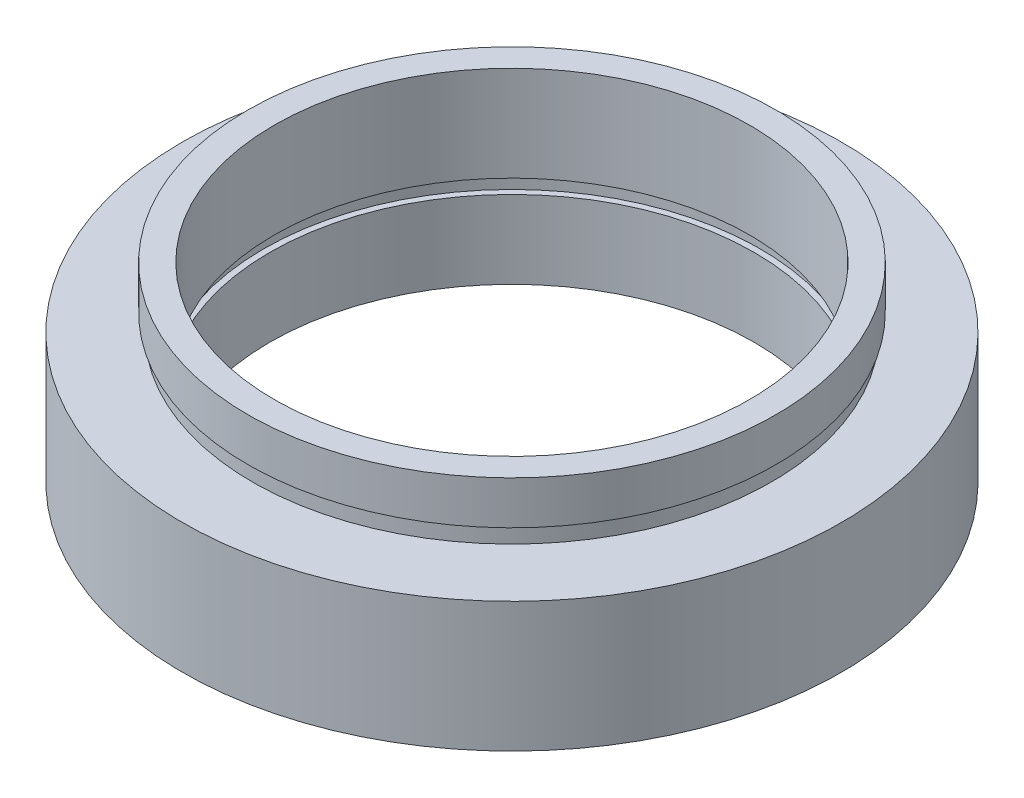
ISO-10303-21;
HEADER;
FILE_DESCRIPTION(('STEP AP214'),'2;1');
FILE_NAME('part.step','',(''),(''),'','','');
FILE_SCHEMA(('AUTOMOTIVE_DESIGN { 1 0 10303 214 1 1 1 1 }'));
ENDSEC;
DATA;
#1=APPLICATION_CONTEXT('core data for automotive mechanical design processes');
#2=APPLICATION_PROTOCOL_DEFINITION('international standard','automotive_design',2000,#1);
#3=PRODUCT_CONTEXT('',#1,'mechanical');
#4=PRODUCT('Part','Part','',(#3));
#5=PRODUCT_RELATED_PRODUCT_CATEGORY('part','',(#4));
#6=PRODUCT_DEFINITION_FORMATION('','',#4);
#7=PRODUCT_DEFINITION_CONTEXT('part definition',#1,'design');
#8=PRODUCT_DEFINITION('design','',#6,#7);
#9=PRODUCT_DEFINITION_SHAPE('','',#8);
#10=(LENGTH_UNIT() NAMED_UNIT(*) SI_UNIT(.MILLI.,.METRE.));
#11=(NAMED_UNIT(*) PLANE_ANGLE_UNIT() SI_UNIT($,.RADIAN.));
#12=(NAMED_UNIT(*) SI_UNIT($,.STERADIAN.) SOLID_ANGLE_UNIT());
#13=UNCERTAINTY_MEASURE_WITH_UNIT(LENGTH_MEASURE(1.E-05),#10,'distance_accuracy_value','');
#14=(GEOMETRIC_REPRESENTATION_CONTEXT(3) GLOBAL_UNCERTAINTY_ASSIGNED_CONTEXT((#13)) GLOBAL_UNIT_ASSIGNED_CONTEXT((#10,
#11,#12)) REPRESENTATION_CONTEXT('',''));
#15=CARTESIAN_POINT('',(0.,0.,0.));
#16=DIRECTION('',(0.,0.,1.));
#17=DIRECTION('',(1.,0.,0.));
#18=AXIS2_PLACEMENT_3D('',#15,#16,#17);
#19=CARTESIAN_POINT('',(19.05,0.,0.));
#20=DIRECTION('',(0.,1.,0.));
#21=DIRECTION('',(-1.,0.,0.));
#22=AXIS2_PLACEMENT_3D('',#19,#20,#21);
#23=PLANE('',#22);
#24=CARTESIAN_POINT('',(0.,0.,0.));
#25=DIRECTION('',(0.,1.,0.));
#26=DIRECTION('',(-1.,0.,0.));
#27=AXIS2_PLACEMENT_3D('',#24,#25,#26);
#28=CIRCLE('',#27,19.05);
#29=CARTESIAN_POINT('',(-19.05,0.,0.));
#30=VERTEX_POINT('',#29);
#31=EDGE_CURVE('E77',#30,#30,#28,.T.);
#32=ORIENTED_EDGE('',*,*,#31,.F.);
#33=EDGE_LOOP('',(#32));
#34=FACE_BOUND('',#33,.T.);
#35=CARTESIAN_POINT('',(0.,0.,0.));
#36=DIRECTION('',(0.,1.,0.));
#37=DIRECTION('',(-1.,0.,0.));
#38=AXIS2_PLACEMENT_3D('',#35,#36,#37);
#39=CIRCLE('',#38,14.);
#40=CARTESIAN_POINT('',(-14.,0.,0.));
#41=VERTEX_POINT('',#40);
#42=EDGE_CURVE('E10',#41,#41,#39,.T.);
#43=ORIENTED_EDGE('',*,*,#42,.T.);
#44=EDGE_LOOP('',(#43));
#45=FACE_BOUND('',#44,.T.);
#46=ADVANCED_FACE('F37',(#34,#45),#23,.F.);
#47=CARTESIAN_POINT('',(0.,16.8860182370821,0.));
#48=DIRECTION('',(0.,1.,0.));
#49=DIRECTION('',(-1.,0.,0.));
#50=AXIS2_PLACEMENT_3D('',#47,#48,#49);
#51=CYLINDRICAL_SURFACE('',#50,14.);
#52=ORIENTED_EDGE('',*,*,#42,.F.);
#53=EDGE_LOOP('',(#52));
#54=FACE_BOUND('',#53,.T.);
#55=CARTESIAN_POINT('',(0.,4.5,0.));
#56=DIRECTION('',(0.,1.,0.));
#57=DIRECTION('',(-1.,0.,0.));
#58=AXIS2_PLACEMENT_3D('',#55,#56,#57);
#59=CIRCLE('',#58,14.);
#60=CARTESIAN_POINT('',(-14.,4.5,0.));
#61=VERTEX_POINT('',#60);
#62=EDGE_CURVE('E43',#61,#61,#59,.T.);
#63=ORIENTED_EDGE('',*,*,#62,.T.);
#64=EDGE_LOOP('',(#63));
#65=FACE_BOUND('',#64,.T.);
#66=ADVANCED_FACE('F84',(#54,#65),#51,.F.);
#67=CARTESIAN_POINT('',(14.,4.5,0.));
#68=DIRECTION('',(0.,-1.,0.));
#69=DIRECTION('',(1.,0.,0.));
#70=AXIS2_PLACEMENT_3D('',#67,#68,#69);
#71=PLANE('',#70);
#72=ORIENTED_EDGE('',*,*,#62,.F.);
#73=EDGE_LOOP('',(#72));
#74=FACE_BOUND('',#73,.T.);
#75=CARTESIAN_POINT('',(0.,4.5,0.));
#76=DIRECTION('',(0.,1.,0.));
#77=DIRECTION('',(-1.,0.,0.));
#78=AXIS2_PLACEMENT_3D('',#75,#76,#77);
#79=CIRCLE('',#78,14.35);
#80=CARTESIAN_POINT('',(-14.35,4.5,0.));
#81=VERTEX_POINT('',#80);
#82=EDGE_CURVE('E47',#81,#81,#79,.T.);
#83=ORIENTED_EDGE('',*,*,#82,.T.);
#84=EDGE_LOOP('',(#83));
#85=FACE_BOUND('',#84,.T.);
#86=ADVANCED_FACE('F88',(#74,#85),#71,.F.);
#87=CARTESIAN_POINT('',(0.,16.8860182370821,0.));
#88=DIRECTION('',(0.,1.,0.));
#89=DIRECTION('',(-1.,0.,0.));
#90=AXIS2_PLACEMENT_3D('',#87,#88,#89);
#91=CYLINDRICAL_SURFACE('',#90,14.35);
#92=ORIENTED_EDGE('',*,*,#82,.F.);
#93=EDGE_LOOP('',(#92));
#94=FACE_BOUND('',#93,.T.);
#95=CARTESIAN_POINT('',(0.,5.5,0.));
#96=DIRECTION('',(0.,1.,0.));
#97=DIRECTION('',(-1.,0.,0.));
#98=AXIS2_PLACEMENT_3D('',#95,#96,#97);
#99=CIRCLE('',#98,14.35);
#100=CARTESIAN_POINT('',(-14.35,5.49999999999999,0.));
#101=VERTEX_POINT('',#100);
#102=EDGE_CURVE('E51',#101,#101,#99,.T.);
#103=ORIENTED_EDGE('',*,*,#102,.T.);
#104=EDGE_LOOP('',(#103));
#105=FACE_BOUND('',#104,.T.);
#106=ADVANCED_FACE('F93',(#94,#105),#91,.F.);
#107=CARTESIAN_POINT('',(13.74,5.5,0.));
#108=DIRECTION('',(0.,1.,0.));
#109=DIRECTION('',(-1.,0.,0.));
#110=AXIS2_PLACEMENT_3D('',#107,#108,#109);
#111=PLANE('',#110);
#112=ORIENTED_EDGE('',*,*,#102,.F.);
#113=EDGE_LOOP('',(#112));
#114=FACE_BOUND('',#113,.T.);
#115=CARTESIAN_POINT('',(0.,5.5,0.));
#116=DIRECTION('',(0.,1.,0.));
#117=DIRECTION('',(-1.,0.,0.));
#118=AXIS2_PLACEMENT_3D('',#115,#116,#117);
#119=CIRCLE('',#118,13.74);
#120=CARTESIAN_POINT('',(-13.74,5.49999999999999,0.));
#121=VERTEX_POINT('',#120);
#122=EDGE_CURVE('E56',#121,#121,#119,.T.);
#123=ORIENTED_EDGE('',*,*,#122,.T.);
#124=EDGE_LOOP('',(#123));
#125=FACE_BOUND('',#124,.T.);
#126=ADVANCED_FACE('F99',(#114,#125),#111,.F.);
#127=CARTESIAN_POINT('',(0.,16.8860182370821,0.));
#128=DIRECTION('',(0.,1.,0.));
#129=DIRECTION('',(-1.,0.,0.));
#130=AXIS2_PLACEMENT_3D('',#127,#128,#129);
#131=CYLINDRICAL_SURFACE('',#130,13.74);
#132=ORIENTED_EDGE('',*,*,#122,.F.);
#133=EDGE_LOOP('',(#132));
#134=FACE_BOUND('',#133,.T.);
#135=CARTESIAN_POINT('',(0.,11.,0.));
#136=DIRECTION('',(0.,1.,0.));
#137=DIRECTION('',(-1.,0.,0.));
#138=AXIS2_PLACEMENT_3D('',#135,#136,#137);
#139=CIRCLE('',#138,13.74);
#140=CARTESIAN_POINT('',(-13.74,11.,0.));
#141=VERTEX_POINT('',#140);
#142=EDGE_CURVE('E59',#141,#141,#139,.T.);
#143=ORIENTED_EDGE('',*,*,#142,.T.);
#144=EDGE_LOOP('',(#143));
#145=FACE_BOUND('',#144,.T.);
#146=ADVANCED_FACE('F103',(#134,#145),#131,.F.);
#147=CARTESIAN_POINT('',(13.74,11.,0.));
#148=DIRECTION('',(0.,-1.,0.));
#149=DIRECTION('',(1.,0.,0.));
#150=AXIS2_PLACEMENT_3D('',#147,#148,#149);
#151=PLANE('',#150);
#152=ORIENTED_EDGE('',*,*,#142,.F.);
#153=EDGE_LOOP('',(#152));
#154=FACE_BOUND('',#153,.T.);
#155=CARTESIAN_POINT('',(0.,11.,0.));
#156=DIRECTION('',(0.,1.,0.));
#157=DIRECTION('',(-1.,0.,0.));
#158=AXIS2_PLACEMENT_3D('',#155,#156,#157);
#159=CIRCLE('',#158,15.26);
#160=CARTESIAN_POINT('',(-15.26,11.,0.));
#161=VERTEX_POINT('',#160);
#162=EDGE_CURVE('E62',#161,#161,#159,.T.);
#163=ORIENTED_EDGE('',*,*,#162,.T.);
#164=EDGE_LOOP('',(#163));
#165=FACE_BOUND('',#164,.T.);
#166=ADVANCED_FACE('F107',(#154,#165),#151,.F.);
#167=CARTESIAN_POINT('',(0.,16.8860182370821,0.));
#168=DIRECTION('',(0.,1.,0.));
#169=DIRECTION('',(-1.,0.,0.));
#170=AXIS2_PLACEMENT_3D('',#167,#168,#169);
#171=CYLINDRICAL_SURFACE('',#170,15.26);
#172=ORIENTED_EDGE('',*,*,#162,.F.);
#173=EDGE_LOOP('',(#172));
#174=FACE_BOUND('',#173,.T.);
#175=CARTESIAN_POINT('',(0.,8.5,0.));
#176=DIRECTION('',(0.,1.,0.));
#177=DIRECTION('',(-1.,0.,0.));
#178=AXIS2_PLACEMENT_3D('',#175,#176,#177);
#179=CIRCLE('',#178,15.26);
#180=CARTESIAN_POINT('',(-15.26,8.49999999999999,0.));
#181=VERTEX_POINT('',#180);
#182=EDGE_CURVE('E65',#181,#181,#179,.T.);
#183=ORIENTED_EDGE('',*,*,#182,.T.);
#184=EDGE_LOOP('',(#183));
#185=FACE_BOUND('',#184,.T.);
#186=ADVANCED_FACE('F111',(#174,#185),#171,.T.);
#187=CARTESIAN_POINT('',(15.26,8.5,0.));
#188=DIRECTION('',(0.,1.,0.));
#189=DIRECTION('',(-1.,0.,0.));
#190=AXIS2_PLACEMENT_3D('',#187,#188,#189);
#191=PLANE('',#190);
#192=ORIENTED_EDGE('',*,*,#182,.F.);
#193=EDGE_LOOP('',(#192));
#194=FACE_BOUND('',#193,.T.);
#195=CARTESIAN_POINT('',(0.,8.5,0.));
#196=DIRECTION('',(0.,1.,0.));
#197=DIRECTION('',(-1.,0.,0.));
#198=AXIS2_PLACEMENT_3D('',#195,#196,#197);
#199=CIRCLE('',#198,15.);
#200=CARTESIAN_POINT('',(-15.,8.49999999999999,0.));
#201=VERTEX_POINT('',#200);
#202=EDGE_CURVE('E68',#201,#201,#199,.T.);
#203=ORIENTED_EDGE('',*,*,#202,.T.);
#204=EDGE_LOOP('',(#203));
#205=FACE_BOUND('',#204,.T.);
#206=ADVANCED_FACE('F115',(#194,#205),#191,.F.);
#207=CARTESIAN_POINT('',(0.,16.8860182370821,0.));
#208=DIRECTION('',(0.,1.,0.));
#209=DIRECTION('',(-1.,0.,0.));
#210=AXIS2_PLACEMENT_3D('',#207,#208,#209);
#211=CYLINDRICAL_SURFACE('',#210,15.);
#212=ORIENTED_EDGE('',*,*,#202,.F.);
#213=EDGE_LOOP('',(#212));
#214=FACE_BOUND('',#213,.T.);
#215=CARTESIAN_POINT('',(0.,7.5,0.));
#216=DIRECTION('',(0.,1.,0.));
#217=DIRECTION('',(-1.,0.,0.));
#218=AXIS2_PLACEMENT_3D('',#215,#216,#217);
#219=CIRCLE('',#218,15.);
#220=CARTESIAN_POINT('',(-15.,7.5,0.));
#221=VERTEX_POINT('',#220);
#222=EDGE_CURVE('E71',#221,#221,#219,.T.);
#223=ORIENTED_EDGE('',*,*,#222,.T.);
#224=EDGE_LOOP('',(#223));
#225=FACE_BOUND('',#224,.T.);
#226=ADVANCED_FACE('F119',(#214,#225),#211,.T.);
#227=CARTESIAN_POINT('',(15.,7.5,0.));
#228=DIRECTION('',(0.,-1.,0.));
#229=DIRECTION('',(1.,0.,0.));
#230=AXIS2_PLACEMENT_3D('',#227,#228,#229);
#231=PLANE('',#230);
#232=ORIENTED_EDGE('',*,*,#222,.F.);
#233=EDGE_LOOP('',(#232));
#234=FACE_BOUND('',#233,.T.);
#235=CARTESIAN_POINT('',(0.,7.5,0.));
#236=DIRECTION('',(0.,1.,0.));
#237=DIRECTION('',(-1.,0.,0.));
#238=AXIS2_PLACEMENT_3D('',#235,#236,#237);
#239=CIRCLE('',#238,19.05);
#240=CARTESIAN_POINT('',(-19.05,7.5,0.));
#241=VERTEX_POINT('',#240);
#242=EDGE_CURVE('E74',#241,#241,#239,.T.);
#243=ORIENTED_EDGE('',*,*,#242,.T.);
#244=EDGE_LOOP('',(#243));
#245=FACE_BOUND('',#244,.T.);
#246=ADVANCED_FACE('F123',(#234,#245),#231,.F.);
#247=CARTESIAN_POINT('',(0.,16.8860182370821,0.));
#248=DIRECTION('',(0.,1.,0.));
#249=DIRECTION('',(-1.,0.,0.));
#250=AXIS2_PLACEMENT_3D('',#247,#248,#249);
#251=CYLINDRICAL_SURFACE('',#250,19.05);
#252=ORIENTED_EDGE('',*,*,#242,.F.);
#253=EDGE_LOOP('',(#252));
#254=FACE_BOUND('',#253,.T.);
#255=ORIENTED_EDGE('',*,*,#31,.T.);
#256=EDGE_LOOP('',(#255));
#257=FACE_BOUND('',#256,.T.);
#258=ADVANCED_FACE('F81',(#254,#257),#251,.T.);
#259=CLOSED_SHELL('',(#46,#66,#86,#106,#126,#146,#166,#186,#206,#226,#246,#258));
#260=MANIFOLD_SOLID_BREP('B2',#259);
#261=ADVANCED_BREP_SHAPE_REPRESENTATION('',(#18,#260),#14);
#262=SHAPE_DEFINITION_REPRESENTATION(#9,#261);
ENDSEC;
END-ISO-10303-21;
